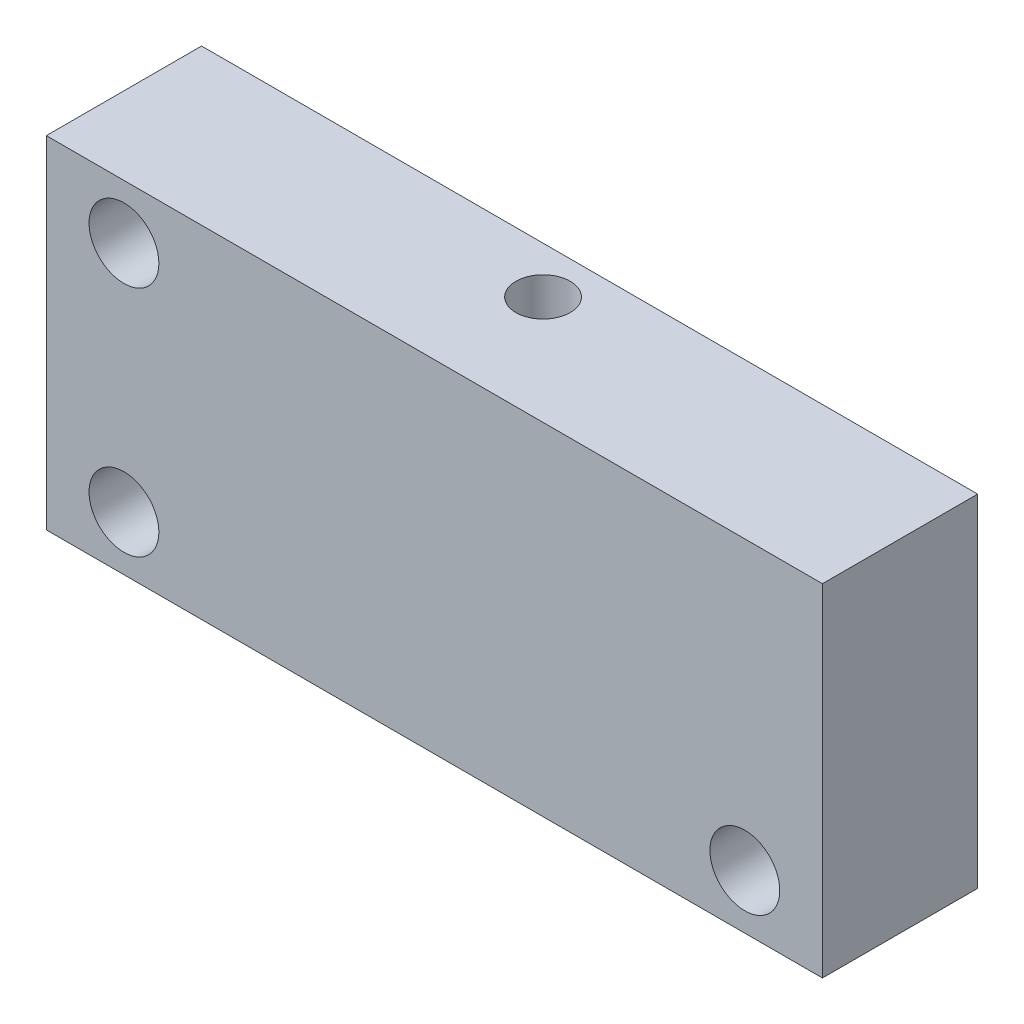
ISO-10303-21;
HEADER;
FILE_DESCRIPTION(('STEP AP214'),'2;1');
FILE_NAME('part.step','',(''),(''),'','','');
FILE_SCHEMA(('AUTOMOTIVE_DESIGN { 1 0 10303 214 1 1 1 1 }'));
ENDSEC;
DATA;
#1=APPLICATION_CONTEXT('core data for automotive mechanical design processes');
#2=APPLICATION_PROTOCOL_DEFINITION('international standard','automotive_design',2000,#1);
#3=PRODUCT_CONTEXT('',#1,'mechanical');
#4=PRODUCT('Part','Part','',(#3));
#5=PRODUCT_RELATED_PRODUCT_CATEGORY('part','',(#4));
#6=PRODUCT_DEFINITION_FORMATION('','',#4);
#7=PRODUCT_DEFINITION_CONTEXT('part definition',#1,'design');
#8=PRODUCT_DEFINITION('design','',#6,#7);
#9=PRODUCT_DEFINITION_SHAPE('','',#8);
#10=(LENGTH_UNIT() NAMED_UNIT(*) SI_UNIT(.MILLI.,.METRE.));
#11=(NAMED_UNIT(*) PLANE_ANGLE_UNIT() SI_UNIT($,.RADIAN.));
#12=(NAMED_UNIT(*) SI_UNIT($,.STERADIAN.) SOLID_ANGLE_UNIT());
#13=UNCERTAINTY_MEASURE_WITH_UNIT(LENGTH_MEASURE(1.E-05),#10,'distance_accuracy_value','');
#14=(GEOMETRIC_REPRESENTATION_CONTEXT(3) GLOBAL_UNCERTAINTY_ASSIGNED_CONTEXT((#13)) GLOBAL_UNIT_ASSIGNED_CONTEXT((#10,
#11,#12)) REPRESENTATION_CONTEXT('',''));
#15=CARTESIAN_POINT('',(0.,0.,0.));
#16=DIRECTION('',(0.,0.,1.));
#17=DIRECTION('',(1.,0.,0.));
#18=AXIS2_PLACEMENT_3D('',#15,#16,#17);
#19=CARTESIAN_POINT('',(-25.,-11.,10.));
#20=DIRECTION('',(1.,0.,0.));
#21=DIRECTION('',(0.,0.,-1.));
#22=AXIS2_PLACEMENT_3D('',#19,#20,#21);
#23=PLANE('',#22);
#24=DIRECTION('',(0.,-1.,0.));
#25=VECTOR('',#24,1.);
#26=CARTESIAN_POINT('',(-25.,-11.,0.));
#27=LINE('',#26,#25);
#28=CARTESIAN_POINT('',(-25.,11.,0.));
#29=VERTEX_POINT('',#28);
#30=CARTESIAN_POINT('',(-25.,-11.,0.));
#31=VERTEX_POINT('',#30);
#32=EDGE_CURVE('E161',#29,#31,#27,.T.);
#33=ORIENTED_EDGE('',*,*,#32,.T.);
#34=DIRECTION('',(0.,0.,-1.));
#35=VECTOR('',#34,1.);
#36=CARTESIAN_POINT('',(-25.,-11.,10.));
#37=LINE('',#36,#35);
#38=CARTESIAN_POINT('',(-25.,-11.,10.));
#39=VERTEX_POINT('',#38);
#40=EDGE_CURVE('E204',#39,#31,#37,.T.);
#41=ORIENTED_EDGE('',*,*,#40,.F.);
#42=DIRECTION('',(0.,-1.,0.));
#43=VECTOR('',#42,1.);
#44=CARTESIAN_POINT('',(-25.,-11.,10.));
#45=LINE('',#44,#43);
#46=CARTESIAN_POINT('',(-25.,11.,10.));
#47=VERTEX_POINT('',#46);
#48=EDGE_CURVE('E178',#47,#39,#45,.T.);
#49=ORIENTED_EDGE('',*,*,#48,.F.);
#50=DIRECTION('',(0.,0.,-1.));
#51=VECTOR('',#50,1.);
#52=CARTESIAN_POINT('',(-25.,11.,10.));
#53=LINE('',#52,#51);
#54=EDGE_CURVE('E188',#47,#29,#53,.T.);
#55=ORIENTED_EDGE('',*,*,#54,.T.);
#56=EDGE_LOOP('',(#33,#41,#49,#55));
#57=FACE_BOUND('',#56,.T.);
#58=ADVANCED_FACE('F33',(#57),#23,.F.);
#59=CARTESIAN_POINT('',(25.,-11.,10.));
#60=DIRECTION('',(0.,1.,0.));
#61=DIRECTION('',(-1.,0.,0.));
#62=AXIS2_PLACEMENT_3D('',#59,#60,#61);
#63=PLANE('',#62);
#64=DIRECTION('',(1.,0.,0.));
#65=VECTOR('',#64,1.);
#66=CARTESIAN_POINT('',(25.,-11.,0.));
#67=LINE('',#66,#65);
#68=CARTESIAN_POINT('',(25.,-11.,0.));
#69=VERTEX_POINT('',#68);
#70=EDGE_CURVE('E191',#31,#69,#67,.T.);
#71=ORIENTED_EDGE('',*,*,#70,.T.);
#72=DIRECTION('',(0.,0.,-1.));
#73=VECTOR('',#72,1.);
#74=CARTESIAN_POINT('',(25.,-11.,10.));
#75=LINE('',#74,#73);
#76=CARTESIAN_POINT('',(25.,-11.,10.));
#77=VERTEX_POINT('',#76);
#78=EDGE_CURVE('E201',#77,#69,#75,.T.);
#79=ORIENTED_EDGE('',*,*,#78,.F.);
#80=DIRECTION('',(1.,0.,0.));
#81=VECTOR('',#80,1.);
#82=CARTESIAN_POINT('',(25.,-11.,10.));
#83=LINE('',#82,#81);
#84=EDGE_CURVE('E181',#39,#77,#83,.T.);
#85=ORIENTED_EDGE('',*,*,#84,.F.);
#86=ORIENTED_EDGE('',*,*,#40,.T.);
#87=EDGE_LOOP('',(#71,#79,#85,#86));
#88=FACE_BOUND('',#87,.T.);
#89=ADVANCED_FACE('F286',(#88),#63,.F.);
#90=CARTESIAN_POINT('',(25.,-11.,10.));
#91=DIRECTION('',(-1.,0.,0.));
#92=DIRECTION('',(0.,0.,1.));
#93=AXIS2_PLACEMENT_3D('',#90,#91,#92);
#94=PLANE('',#93);
#95=DIRECTION('',(0.,1.,0.));
#96=VECTOR('',#95,1.);
#97=CARTESIAN_POINT('',(25.,-11.,0.));
#98=LINE('',#97,#96);
#99=CARTESIAN_POINT('',(25.,11.,0.));
#100=VERTEX_POINT('',#99);
#101=EDGE_CURVE('E193',#69,#100,#98,.T.);
#102=ORIENTED_EDGE('',*,*,#101,.T.);
#103=DIRECTION('',(0.,0.,-1.));
#104=VECTOR('',#103,1.);
#105=CARTESIAN_POINT('',(25.,11.,10.));
#106=LINE('',#105,#104);
#107=CARTESIAN_POINT('',(25.,11.,10.));
#108=VERTEX_POINT('',#107);
#109=EDGE_CURVE('E198',#108,#100,#106,.T.);
#110=ORIENTED_EDGE('',*,*,#109,.F.);
#111=DIRECTION('',(0.,1.,0.));
#112=VECTOR('',#111,1.);
#113=CARTESIAN_POINT('',(25.,-11.,10.));
#114=LINE('',#113,#112);
#115=EDGE_CURVE('E184',#77,#108,#114,.T.);
#116=ORIENTED_EDGE('',*,*,#115,.F.);
#117=ORIENTED_EDGE('',*,*,#78,.T.);
#118=EDGE_LOOP('',(#102,#110,#116,#117));
#119=FACE_BOUND('',#118,.T.);
#120=ADVANCED_FACE('F291',(#119),#94,.F.);
#121=CARTESIAN_POINT('',(25.,11.,10.));
#122=DIRECTION('',(0.,-1.,0.));
#123=DIRECTION('',(1.,0.,0.));
#124=AXIS2_PLACEMENT_3D('',#121,#122,#123);
#125=PLANE('',#124);
#126=CARTESIAN_POINT('',(0.,11.,3.));
#127=DIRECTION('',(0.,1.,0.));
#128=DIRECTION('',(-1.,0.,0.));
#129=AXIS2_PLACEMENT_3D('',#126,#127,#128);
#130=CIRCLE('',#129,1.75);
#131=CARTESIAN_POINT('',(-1.75,11.,3.));
#132=VERTEX_POINT('',#131);
#133=EDGE_CURVE('E247',#132,#132,#130,.T.);
#134=ORIENTED_EDGE('',*,*,#133,.F.);
#135=EDGE_LOOP('',(#134));
#136=FACE_BOUND('',#135,.T.);
#137=DIRECTION('',(-1.,0.,0.));
#138=VECTOR('',#137,1.);
#139=CARTESIAN_POINT('',(25.,11.,0.));
#140=LINE('',#139,#138);
#141=EDGE_CURVE('E182',#100,#29,#140,.T.);
#142=ORIENTED_EDGE('',*,*,#141,.T.);
#143=ORIENTED_EDGE('',*,*,#54,.F.);
#144=DIRECTION('',(-1.,0.,0.));
#145=VECTOR('',#144,1.);
#146=CARTESIAN_POINT('',(25.,11.,10.));
#147=LINE('',#146,#145);
#148=EDGE_CURVE('E186',#108,#47,#147,.T.);
#149=ORIENTED_EDGE('',*,*,#148,.F.);
#150=ORIENTED_EDGE('',*,*,#109,.T.);
#151=EDGE_LOOP('',(#142,#143,#149,#150));
#152=FACE_BOUND('',#151,.T.);
#153=ADVANCED_FACE('F307',(#136,#152),#125,.F.);
#154=CARTESIAN_POINT('',(0.,0.,10.));
#155=DIRECTION('',(0.,0.,1.));
#156=DIRECTION('',(1.,0.,0.));
#157=AXIS2_PLACEMENT_3D('',#154,#155,#156);
#158=PLANE('',#157);
#159=CARTESIAN_POINT('',(-20.,7.5,10.));
#160=DIRECTION('',(0.,0.,1.));
#161=DIRECTION('',(1.,0.,0.));
#162=AXIS2_PLACEMENT_3D('',#159,#160,#161);
#163=CIRCLE('',#162,2.25);
#164=CARTESIAN_POINT('',(-17.75,7.5,10.));
#165=VERTEX_POINT('',#164);
#166=EDGE_CURVE('E162',#165,#165,#163,.T.);
#167=ORIENTED_EDGE('',*,*,#166,.F.);
#168=EDGE_LOOP('',(#167));
#169=FACE_BOUND('',#168,.T.);
#170=CARTESIAN_POINT('',(-20.,-7.5,10.));
#171=DIRECTION('',(0.,0.,1.));
#172=DIRECTION('',(1.,0.,0.));
#173=AXIS2_PLACEMENT_3D('',#170,#171,#172);
#174=CIRCLE('',#173,2.25);
#175=CARTESIAN_POINT('',(-17.75,-7.5,10.));
#176=VERTEX_POINT('',#175);
#177=EDGE_CURVE('E168',#176,#176,#174,.T.);
#178=ORIENTED_EDGE('',*,*,#177,.F.);
#179=EDGE_LOOP('',(#178));
#180=FACE_BOUND('',#179,.T.);
#181=CARTESIAN_POINT('',(20.,-7.5,10.));
#182=DIRECTION('',(0.,0.,1.));
#183=DIRECTION('',(1.,0.,0.));
#184=AXIS2_PLACEMENT_3D('',#181,#182,#183);
#185=CIRCLE('',#184,2.25);
#186=CARTESIAN_POINT('',(22.25,-7.5,10.));
#187=VERTEX_POINT('',#186);
#188=EDGE_CURVE('E174',#187,#187,#185,.T.);
#189=ORIENTED_EDGE('',*,*,#188,.F.);
#190=EDGE_LOOP('',(#189));
#191=FACE_BOUND('',#190,.T.);
#192=ORIENTED_EDGE('',*,*,#48,.T.);
#193=ORIENTED_EDGE('',*,*,#84,.T.);
#194=ORIENTED_EDGE('',*,*,#115,.T.);
#195=ORIENTED_EDGE('',*,*,#148,.T.);
#196=EDGE_LOOP('',(#192,#193,#194,#195));
#197=FACE_BOUND('',#196,.T.);
#198=ADVANCED_FACE('F303',(#169,#180,#191,#197),#158,.T.);
#199=CARTESIAN_POINT('',(0.,0.,0.));
#200=DIRECTION('',(0.,0.,1.));
#201=DIRECTION('',(1.,0.,0.));
#202=AXIS2_PLACEMENT_3D('',#199,#200,#201);
#203=PLANE('',#202);
#204=DIRECTION('',(1.,0.,0.));
#205=VECTOR('',#204,1.);
#206=CARTESIAN_POINT('',(-6.45,6.45,0.));
#207=LINE('',#206,#205);
#208=CARTESIAN_POINT('',(-4.45,6.45,0.));
#209=VERTEX_POINT('',#208);
#210=CARTESIAN_POINT('',(4.45,6.45,0.));
#211=VERTEX_POINT('',#210);
#212=EDGE_CURVE('E140',#209,#211,#207,.T.);
#213=ORIENTED_EDGE('',*,*,#212,.F.);
#214=CARTESIAN_POINT('',(-6.45,6.45,0.));
#215=DIRECTION('',(0.,0.,-1.));
#216=DIRECTION('',(-1.,0.,0.));
#217=AXIS2_PLACEMENT_3D('',#214,#215,#216);
#218=CIRCLE('',#217,2.);
#219=CARTESIAN_POINT('',(-6.45,4.45,0.));
#220=VERTEX_POINT('',#219);
#221=EDGE_CURVE('E252',#220,#209,#218,.T.);
#222=ORIENTED_EDGE('',*,*,#221,.F.);
#223=DIRECTION('',(0.,1.,0.));
#224=VECTOR('',#223,1.);
#225=CARTESIAN_POINT('',(-6.45,-6.45,0.));
#226=LINE('',#225,#224);
#227=CARTESIAN_POINT('',(-6.45,-4.45,0.));
#228=VERTEX_POINT('',#227);
#229=EDGE_CURVE('E148',#228,#220,#226,.T.);
#230=ORIENTED_EDGE('',*,*,#229,.F.);
#231=CARTESIAN_POINT('',(-6.45,-6.45,0.));
#232=DIRECTION('',(0.,0.,-1.));
#233=DIRECTION('',(-1.,0.,0.));
#234=AXIS2_PLACEMENT_3D('',#231,#232,#233);
#235=CIRCLE('',#234,2.);
#236=CARTESIAN_POINT('',(-4.45,-6.45,0.));
#237=VERTEX_POINT('',#236);
#238=EDGE_CURVE('E241',#237,#228,#235,.T.);
#239=ORIENTED_EDGE('',*,*,#238,.F.);
#240=DIRECTION('',(-1.,0.,0.));
#241=VECTOR('',#240,1.);
#242=CARTESIAN_POINT('',(-6.45,-6.45,0.));
#243=LINE('',#242,#241);
#244=CARTESIAN_POINT('',(4.45,-6.45,0.));
#245=VERTEX_POINT('',#244);
#246=EDGE_CURVE('E154',#245,#237,#243,.T.);
#247=ORIENTED_EDGE('',*,*,#246,.F.);
#248=CARTESIAN_POINT('',(6.45,-6.45,0.));
#249=DIRECTION('',(0.,0.,-1.));
#250=DIRECTION('',(-1.,0.,0.));
#251=AXIS2_PLACEMENT_3D('',#248,#249,#250);
#252=CIRCLE('',#251,2.);
#253=CARTESIAN_POINT('',(6.45,-4.45,0.));
#254=VERTEX_POINT('',#253);
#255=EDGE_CURVE('E239',#254,#245,#252,.T.);
#256=ORIENTED_EDGE('',*,*,#255,.F.);
#257=DIRECTION('',(0.,-1.,0.));
#258=VECTOR('',#257,1.);
#259=CARTESIAN_POINT('',(6.45,-6.45,0.));
#260=LINE('',#259,#258);
#261=CARTESIAN_POINT('',(6.45,4.45,0.));
#262=VERTEX_POINT('',#261);
#263=EDGE_CURVE('E143',#262,#254,#260,.T.);
#264=ORIENTED_EDGE('',*,*,#263,.F.);
#265=CARTESIAN_POINT('',(6.45,6.45,0.));
#266=DIRECTION('',(0.,0.,-1.));
#267=DIRECTION('',(-1.,0.,0.));
#268=AXIS2_PLACEMENT_3D('',#265,#266,#267);
#269=CIRCLE('',#268,2.);
#270=EDGE_CURVE('E123',#211,#262,#269,.T.);
#271=ORIENTED_EDGE('',*,*,#270,.F.);
#272=EDGE_LOOP('',(#213,#222,#230,#239,#247,#256,#264,#271));
#273=FACE_BOUND('',#272,.T.);
#274=CARTESIAN_POINT('',(-20.,7.5,0.));
#275=DIRECTION('',(0.,0.,1.));
#276=DIRECTION('',(1.,0.,0.));
#277=AXIS2_PLACEMENT_3D('',#274,#275,#276);
#278=CIRCLE('',#277,2.25);
#279=CARTESIAN_POINT('',(-17.75,7.5,0.));
#280=VERTEX_POINT('',#279);
#281=EDGE_CURVE('E158',#280,#280,#278,.T.);
#282=ORIENTED_EDGE('',*,*,#281,.T.);
#283=EDGE_LOOP('',(#282));
#284=FACE_BOUND('',#283,.T.);
#285=CARTESIAN_POINT('',(-20.,-7.5,0.));
#286=DIRECTION('',(0.,0.,1.));
#287=DIRECTION('',(1.,0.,0.));
#288=AXIS2_PLACEMENT_3D('',#285,#286,#287);
#289=CIRCLE('',#288,2.25);
#290=CARTESIAN_POINT('',(-17.75,-7.5,0.));
#291=VERTEX_POINT('',#290);
#292=EDGE_CURVE('E165',#291,#291,#289,.T.);
#293=ORIENTED_EDGE('',*,*,#292,.T.);
#294=EDGE_LOOP('',(#293));
#295=FACE_BOUND('',#294,.T.);
#296=CARTESIAN_POINT('',(20.,-7.5,0.));
#297=DIRECTION('',(0.,0.,1.));
#298=DIRECTION('',(1.,0.,0.));
#299=AXIS2_PLACEMENT_3D('',#296,#297,#298);
#300=CIRCLE('',#299,2.25);
#301=CARTESIAN_POINT('',(22.25,-7.5,0.));
#302=VERTEX_POINT('',#301);
#303=EDGE_CURVE('E171',#302,#302,#300,.T.);
#304=ORIENTED_EDGE('',*,*,#303,.T.);
#305=EDGE_LOOP('',(#304));
#306=FACE_BOUND('',#305,.T.);
#307=ORIENTED_EDGE('',*,*,#32,.F.);
#308=ORIENTED_EDGE('',*,*,#141,.F.);
#309=ORIENTED_EDGE('',*,*,#101,.F.);
#310=ORIENTED_EDGE('',*,*,#70,.F.);
#311=EDGE_LOOP('',(#307,#308,#309,#310));
#312=FACE_BOUND('',#311,.T.);
#313=ADVANCED_FACE('F137',(#273,#284,#295,#306,#312),#203,.F.);
#314=CARTESIAN_POINT('',(20.,-7.5,0.));
#315=DIRECTION('',(0.,0.,1.));
#316=DIRECTION('',(1.,0.,0.));
#317=AXIS2_PLACEMENT_3D('',#314,#315,#316);
#318=CYLINDRICAL_SURFACE('',#317,2.25);
#319=ORIENTED_EDGE('',*,*,#303,.F.);
#320=EDGE_LOOP('',(#319));
#321=FACE_BOUND('',#320,.T.);
#322=ORIENTED_EDGE('',*,*,#188,.T.);
#323=EDGE_LOOP('',(#322));
#324=FACE_BOUND('',#323,.T.);
#325=ADVANCED_FACE('F320',(#321,#324),#318,.F.);
#326=CARTESIAN_POINT('',(-20.,-7.5,0.));
#327=DIRECTION('',(0.,0.,1.));
#328=DIRECTION('',(1.,0.,0.));
#329=AXIS2_PLACEMENT_3D('',#326,#327,#328);
#330=CYLINDRICAL_SURFACE('',#329,2.25);
#331=ORIENTED_EDGE('',*,*,#292,.F.);
#332=EDGE_LOOP('',(#331));
#333=FACE_BOUND('',#332,.T.);
#334=ORIENTED_EDGE('',*,*,#177,.T.);
#335=EDGE_LOOP('',(#334));
#336=FACE_BOUND('',#335,.T.);
#337=ADVANCED_FACE('F326',(#333,#336),#330,.F.);
#338=CARTESIAN_POINT('',(-20.,7.5,0.));
#339=DIRECTION('',(0.,0.,1.));
#340=DIRECTION('',(1.,0.,0.));
#341=AXIS2_PLACEMENT_3D('',#338,#339,#340);
#342=CYLINDRICAL_SURFACE('',#341,2.25);
#343=ORIENTED_EDGE('',*,*,#281,.F.);
#344=EDGE_LOOP('',(#343));
#345=FACE_BOUND('',#344,.T.);
#346=ORIENTED_EDGE('',*,*,#166,.T.);
#347=EDGE_LOOP('',(#346));
#348=FACE_BOUND('',#347,.T.);
#349=ADVANCED_FACE('F330',(#345,#348),#342,.F.);
#350=CARTESIAN_POINT('',(6.45,-6.45,6.));
#351=DIRECTION('',(1.,0.,0.));
#352=DIRECTION('',(0.,0.,-1.));
#353=AXIS2_PLACEMENT_3D('',#350,#351,#352);
#354=PLANE('',#353);
#355=ORIENTED_EDGE('',*,*,#263,.T.);
#356=DIRECTION('',(0.,0.,-1.));
#357=VECTOR('',#356,1.);
#358=CARTESIAN_POINT('',(6.45,-4.45,6.1));
#359=LINE('',#358,#357);
#360=CARTESIAN_POINT('',(6.45,-4.45,6.));
#361=VERTEX_POINT('',#360);
#362=EDGE_CURVE('E214',#254,#361,#359,.F.);
#363=ORIENTED_EDGE('',*,*,#362,.T.);
#364=DIRECTION('',(0.,-1.,0.));
#365=VECTOR('',#364,1.);
#366=CARTESIAN_POINT('',(6.45,-6.45,6.));
#367=LINE('',#366,#365);
#368=CARTESIAN_POINT('',(6.45,4.45,6.));
#369=VERTEX_POINT('',#368);
#370=EDGE_CURVE('E147',#369,#361,#367,.T.);
#371=ORIENTED_EDGE('',*,*,#370,.F.);
#372=DIRECTION('',(0.,0.,-1.));
#373=VECTOR('',#372,1.);
#374=CARTESIAN_POINT('',(6.45,4.45,6.1));
#375=LINE('',#374,#373);
#376=EDGE_CURVE('E131',#369,#262,#375,.T.);
#377=ORIENTED_EDGE('',*,*,#376,.T.);
#378=EDGE_LOOP('',(#355,#363,#371,#377));
#379=FACE_BOUND('',#378,.T.);
#380=ADVANCED_FACE('F222',(#379),#354,.F.);
#381=CARTESIAN_POINT('',(-6.45,6.45,6.));
#382=DIRECTION('',(0.,1.,0.));
#383=DIRECTION('',(-1.,0.,0.));
#384=AXIS2_PLACEMENT_3D('',#381,#382,#383);
#385=PLANE('',#384);
#386=CARTESIAN_POINT('',(0.,6.45,3.));
#387=DIRECTION('',(0.,1.,0.));
#388=DIRECTION('',(-1.,0.,0.));
#389=AXIS2_PLACEMENT_3D('',#386,#387,#388);
#390=CIRCLE('',#389,1.75);
#391=CARTESIAN_POINT('',(-1.75,6.45,3.));
#392=VERTEX_POINT('',#391);
#393=EDGE_CURVE('E36',#392,#392,#390,.T.);
#394=ORIENTED_EDGE('',*,*,#393,.T.);
#395=EDGE_LOOP('',(#394));
#396=FACE_BOUND('',#395,.T.);
#397=DIRECTION('',(1.,0.,0.));
#398=VECTOR('',#397,1.);
#399=CARTESIAN_POINT('',(-6.45,6.45,6.));
#400=LINE('',#399,#398);
#401=CARTESIAN_POINT('',(-4.45,6.45,6.));
#402=VERTEX_POINT('',#401);
#403=CARTESIAN_POINT('',(4.45,6.45,6.));
#404=VERTEX_POINT('',#403);
#405=EDGE_CURVE('E177',#402,#404,#400,.T.);
#406=ORIENTED_EDGE('',*,*,#405,.F.);
#407=DIRECTION('',(0.,0.,-1.));
#408=VECTOR('',#407,1.);
#409=CARTESIAN_POINT('',(-4.45,6.45,6.1));
#410=LINE('',#409,#408);
#411=EDGE_CURVE('E47',#402,#209,#410,.T.);
#412=ORIENTED_EDGE('',*,*,#411,.T.);
#413=ORIENTED_EDGE('',*,*,#212,.T.);
#414=DIRECTION('',(0.,0.,-1.));
#415=VECTOR('',#414,1.);
#416=CARTESIAN_POINT('',(4.45,6.45,6.1));
#417=LINE('',#416,#415);
#418=EDGE_CURVE('E120',#211,#404,#417,.F.);
#419=ORIENTED_EDGE('',*,*,#418,.T.);
#420=EDGE_LOOP('',(#406,#412,#413,#419));
#421=FACE_BOUND('',#420,.T.);
#422=ADVANCED_FACE('F146',(#396,#421),#385,.F.);
#423=CARTESIAN_POINT('',(-6.45,-6.45,6.));
#424=DIRECTION('',(-1.,0.,0.));
#425=DIRECTION('',(0.,0.,1.));
#426=AXIS2_PLACEMENT_3D('',#423,#424,#425);
#427=PLANE('',#426);
#428=ORIENTED_EDGE('',*,*,#229,.T.);
#429=DIRECTION('',(0.,0.,-1.));
#430=VECTOR('',#429,1.);
#431=CARTESIAN_POINT('',(-6.45,4.45,6.1));
#432=LINE('',#431,#430);
#433=CARTESIAN_POINT('',(-6.45,4.45,6.));
#434=VERTEX_POINT('',#433);
#435=EDGE_CURVE('E223',#220,#434,#432,.F.);
#436=ORIENTED_EDGE('',*,*,#435,.T.);
#437=DIRECTION('',(0.,1.,0.));
#438=VECTOR('',#437,1.);
#439=CARTESIAN_POINT('',(-6.45,-6.45,6.));
#440=LINE('',#439,#438);
#441=CARTESIAN_POINT('',(-6.45,-4.45,6.));
#442=VERTEX_POINT('',#441);
#443=EDGE_CURVE('E227',#442,#434,#440,.T.);
#444=ORIENTED_EDGE('',*,*,#443,.F.);
#445=DIRECTION('',(0.,0.,-1.));
#446=VECTOR('',#445,1.);
#447=CARTESIAN_POINT('',(-6.45,-4.45,6.1));
#448=LINE('',#447,#446);
#449=EDGE_CURVE('E55',#442,#228,#448,.T.);
#450=ORIENTED_EDGE('',*,*,#449,.T.);
#451=EDGE_LOOP('',(#428,#436,#444,#450));
#452=FACE_BOUND('',#451,.T.);
#453=ADVANCED_FACE('F268',(#452),#427,.F.);
#454=CARTESIAN_POINT('',(-6.45,-6.45,6.));
#455=DIRECTION('',(0.,-1.,0.));
#456=DIRECTION('',(1.,0.,0.));
#457=AXIS2_PLACEMENT_3D('',#454,#455,#456);
#458=PLANE('',#457);
#459=DIRECTION('',(-1.,0.,0.));
#460=VECTOR('',#459,1.);
#461=CARTESIAN_POINT('',(-6.45,-6.45,6.));
#462=LINE('',#461,#460);
#463=CARTESIAN_POINT('',(4.45,-6.45,6.));
#464=VERTEX_POINT('',#463);
#465=CARTESIAN_POINT('',(-4.45,-6.45,6.));
#466=VERTEX_POINT('',#465);
#467=EDGE_CURVE('E151',#464,#466,#462,.T.);
#468=ORIENTED_EDGE('',*,*,#467,.F.);
#469=DIRECTION('',(0.,0.,-1.));
#470=VECTOR('',#469,1.);
#471=CARTESIAN_POINT('',(4.45,-6.45,6.1));
#472=LINE('',#471,#470);
#473=EDGE_CURVE('E216',#464,#245,#472,.T.);
#474=ORIENTED_EDGE('',*,*,#473,.T.);
#475=ORIENTED_EDGE('',*,*,#246,.T.);
#476=DIRECTION('',(0.,0.,-1.));
#477=VECTOR('',#476,1.);
#478=CARTESIAN_POINT('',(-4.45,-6.45,6.1));
#479=LINE('',#478,#477);
#480=EDGE_CURVE('E237',#237,#466,#479,.F.);
#481=ORIENTED_EDGE('',*,*,#480,.T.);
#482=EDGE_LOOP('',(#468,#474,#475,#481));
#483=FACE_BOUND('',#482,.T.);
#484=ADVANCED_FACE('F236',(#483),#458,.F.);
#485=CARTESIAN_POINT('',(0.,0.,6.));
#486=DIRECTION('',(0.,0.,-1.));
#487=DIRECTION('',(-1.,0.,0.));
#488=AXIS2_PLACEMENT_3D('',#485,#486,#487);
#489=PLANE('',#488);
#490=CARTESIAN_POINT('',(-6.45,6.45,6.));
#491=DIRECTION('',(0.,0.,-1.));
#492=DIRECTION('',(-1.,0.,0.));
#493=AXIS2_PLACEMENT_3D('',#490,#491,#492);
#494=CIRCLE('',#493,2.);
#495=EDGE_CURVE('E11',#402,#434,#494,.T.);
#496=ORIENTED_EDGE('',*,*,#495,.F.);
#497=ORIENTED_EDGE('',*,*,#405,.T.);
#498=CARTESIAN_POINT('',(6.45,6.45,6.));
#499=DIRECTION('',(0.,0.,-1.));
#500=DIRECTION('',(-1.,0.,0.));
#501=AXIS2_PLACEMENT_3D('',#498,#499,#500);
#502=CIRCLE('',#501,2.);
#503=EDGE_CURVE('E126',#369,#404,#502,.T.);
#504=ORIENTED_EDGE('',*,*,#503,.F.);
#505=ORIENTED_EDGE('',*,*,#370,.T.);
#506=CARTESIAN_POINT('',(6.45,-6.45,6.));
#507=DIRECTION('',(0.,0.,-1.));
#508=DIRECTION('',(-1.,0.,0.));
#509=AXIS2_PLACEMENT_3D('',#506,#507,#508);
#510=CIRCLE('',#509,2.);
#511=EDGE_CURVE('E41',#464,#361,#510,.T.);
#512=ORIENTED_EDGE('',*,*,#511,.F.);
#513=ORIENTED_EDGE('',*,*,#467,.T.);
#514=CARTESIAN_POINT('',(-6.45,-6.45,6.));
#515=DIRECTION('',(0.,0.,-1.));
#516=DIRECTION('',(-1.,0.,0.));
#517=AXIS2_PLACEMENT_3D('',#514,#515,#516);
#518=CIRCLE('',#517,2.);
#519=EDGE_CURVE('E208',#442,#466,#518,.T.);
#520=ORIENTED_EDGE('',*,*,#519,.F.);
#521=ORIENTED_EDGE('',*,*,#443,.T.);
#522=EDGE_LOOP('',(#496,#497,#504,#505,#512,#513,#520,#521));
#523=FACE_BOUND('',#522,.T.);
#524=ADVANCED_FACE('F225',(#523),#489,.T.);
#525=CARTESIAN_POINT('',(6.45,6.45,6.1));
#526=DIRECTION('',(0.,0.,-1.));
#527=DIRECTION('',(-1.,0.,0.));
#528=AXIS2_PLACEMENT_3D('',#525,#526,#527);
#529=CYLINDRICAL_SURFACE('',#528,2.);
#530=CARTESIAN_POINT('',(6.45,6.45,6.1));
#531=DIRECTION('',(0.,0.,-1.));
#532=DIRECTION('',(-1.,0.,0.));
#533=AXIS2_PLACEMENT_3D('',#530,#531,#532);
#534=CIRCLE('',#533,2.);
#535=CARTESIAN_POINT('',(4.45,6.45,6.1));
#536=VERTEX_POINT('',#535);
#537=EDGE_CURVE('E132',#536,#536,#534,.T.);
#538=ORIENTED_EDGE('',*,*,#537,.F.);
#539=EDGE_LOOP('',(#538));
#540=FACE_BOUND('',#539,.T.);
#541=ORIENTED_EDGE('',*,*,#503,.T.);
#542=ORIENTED_EDGE('',*,*,#418,.F.);
#543=ORIENTED_EDGE('',*,*,#270,.T.);
#544=ORIENTED_EDGE('',*,*,#376,.F.);
#545=EDGE_LOOP('',(#541,#542,#543,#544));
#546=FACE_BOUND('',#545,.T.);
#547=ADVANCED_FACE('F122',(#540,#546),#529,.F.);
#548=CARTESIAN_POINT('',(6.45,6.45,6.1));
#549=DIRECTION('',(0.,0.,-1.));
#550=DIRECTION('',(-1.,0.,0.));
#551=AXIS2_PLACEMENT_3D('',#548,#549,#550);
#552=PLANE('',#551);
#553=ORIENTED_EDGE('',*,*,#537,.T.);
#554=EDGE_LOOP('',(#553));
#555=FACE_BOUND('',#554,.T.);
#556=ADVANCED_FACE('F348',(#555),#552,.T.);
#557=CARTESIAN_POINT('',(-6.45,-6.45,6.1));
#558=DIRECTION('',(0.,0.,-1.));
#559=DIRECTION('',(-1.,0.,0.));
#560=AXIS2_PLACEMENT_3D('',#557,#558,#559);
#561=CYLINDRICAL_SURFACE('',#560,2.);
#562=CARTESIAN_POINT('',(-6.45,-6.45,6.1));
#563=DIRECTION('',(0.,0.,-1.));
#564=DIRECTION('',(-1.,0.,0.));
#565=AXIS2_PLACEMENT_3D('',#562,#563,#564);
#566=CIRCLE('',#565,2.);
#567=CARTESIAN_POINT('',(-8.45,-6.45,6.1));
#568=VERTEX_POINT('',#567);
#569=EDGE_CURVE('E242',#568,#568,#566,.T.);
#570=ORIENTED_EDGE('',*,*,#569,.F.);
#571=EDGE_LOOP('',(#570));
#572=FACE_BOUND('',#571,.T.);
#573=ORIENTED_EDGE('',*,*,#519,.T.);
#574=ORIENTED_EDGE('',*,*,#480,.F.);
#575=ORIENTED_EDGE('',*,*,#238,.T.);
#576=ORIENTED_EDGE('',*,*,#449,.F.);
#577=EDGE_LOOP('',(#573,#574,#575,#576));
#578=FACE_BOUND('',#577,.T.);
#579=ADVANCED_FACE('F352',(#572,#578),#561,.F.);
#580=CARTESIAN_POINT('',(-6.45,-6.45,6.1));
#581=DIRECTION('',(0.,0.,-1.));
#582=DIRECTION('',(-1.,0.,0.));
#583=AXIS2_PLACEMENT_3D('',#580,#581,#582);
#584=PLANE('',#583);
#585=ORIENTED_EDGE('',*,*,#569,.T.);
#586=EDGE_LOOP('',(#585));
#587=FACE_BOUND('',#586,.T.);
#588=ADVANCED_FACE('F355',(#587),#584,.T.);
#589=CARTESIAN_POINT('',(6.45,-6.45,6.1));
#590=DIRECTION('',(0.,0.,-1.));
#591=DIRECTION('',(-1.,0.,0.));
#592=AXIS2_PLACEMENT_3D('',#589,#590,#591);
#593=CYLINDRICAL_SURFACE('',#592,2.);
#594=CARTESIAN_POINT('',(6.45,-6.45,6.1));
#595=DIRECTION('',(0.,0.,-1.));
#596=DIRECTION('',(-1.,0.,0.));
#597=AXIS2_PLACEMENT_3D('',#594,#595,#596);
#598=CIRCLE('',#597,2.);
#599=CARTESIAN_POINT('',(4.45,-6.45,6.1));
#600=VERTEX_POINT('',#599);
#601=EDGE_CURVE('E254',#600,#600,#598,.T.);
#602=ORIENTED_EDGE('',*,*,#601,.F.);
#603=EDGE_LOOP('',(#602));
#604=FACE_BOUND('',#603,.T.);
#605=ORIENTED_EDGE('',*,*,#255,.T.);
#606=ORIENTED_EDGE('',*,*,#473,.F.);
#607=ORIENTED_EDGE('',*,*,#511,.T.);
#608=ORIENTED_EDGE('',*,*,#362,.F.);
#609=EDGE_LOOP('',(#605,#606,#607,#608));
#610=FACE_BOUND('',#609,.T.);
#611=ADVANCED_FACE('F213',(#604,#610),#593,.F.);
#612=CARTESIAN_POINT('',(6.45,-6.45,6.1));
#613=DIRECTION('',(0.,0.,-1.));
#614=DIRECTION('',(-1.,0.,0.));
#615=AXIS2_PLACEMENT_3D('',#612,#613,#614);
#616=PLANE('',#615);
#617=ORIENTED_EDGE('',*,*,#601,.T.);
#618=EDGE_LOOP('',(#617));
#619=FACE_BOUND('',#618,.T.);
#620=ADVANCED_FACE('F272',(#619),#616,.T.);
#621=CARTESIAN_POINT('',(-6.45,6.45,6.1));
#622=DIRECTION('',(0.,0.,-1.));
#623=DIRECTION('',(-1.,0.,0.));
#624=AXIS2_PLACEMENT_3D('',#621,#622,#623);
#625=CYLINDRICAL_SURFACE('',#624,2.);
#626=CARTESIAN_POINT('',(-6.45,6.45,6.1));
#627=DIRECTION('',(0.,0.,-1.));
#628=DIRECTION('',(-1.,0.,0.));
#629=AXIS2_PLACEMENT_3D('',#626,#627,#628);
#630=CIRCLE('',#629,2.);
#631=CARTESIAN_POINT('',(-8.45,6.45,6.1));
#632=VERTEX_POINT('',#631);
#633=EDGE_CURVE('E144',#632,#632,#630,.T.);
#634=ORIENTED_EDGE('',*,*,#633,.F.);
#635=EDGE_LOOP('',(#634));
#636=FACE_BOUND('',#635,.T.);
#637=ORIENTED_EDGE('',*,*,#495,.T.);
#638=ORIENTED_EDGE('',*,*,#435,.F.);
#639=ORIENTED_EDGE('',*,*,#221,.T.);
#640=ORIENTED_EDGE('',*,*,#411,.F.);
#641=EDGE_LOOP('',(#637,#638,#639,#640));
#642=FACE_BOUND('',#641,.T.);
#643=ADVANCED_FACE('F269',(#636,#642),#625,.F.);
#644=CARTESIAN_POINT('',(-6.45,6.45,6.1));
#645=DIRECTION('',(0.,0.,-1.));
#646=DIRECTION('',(-1.,0.,0.));
#647=AXIS2_PLACEMENT_3D('',#644,#645,#646);
#648=PLANE('',#647);
#649=ORIENTED_EDGE('',*,*,#633,.T.);
#650=EDGE_LOOP('',(#649));
#651=FACE_BOUND('',#650,.T.);
#652=ADVANCED_FACE('F271',(#651),#648,.T.);
#653=CARTESIAN_POINT('',(0.,4.9,3.));
#654=DIRECTION('',(0.,1.,0.));
#655=DIRECTION('',(-1.,0.,0.));
#656=AXIS2_PLACEMENT_3D('',#653,#654,#655);
#657=CYLINDRICAL_SURFACE('',#656,1.75);
#658=ORIENTED_EDGE('',*,*,#133,.T.);
#659=EDGE_LOOP('',(#658));
#660=FACE_BOUND('',#659,.T.);
#661=ORIENTED_EDGE('',*,*,#393,.F.);
#662=EDGE_LOOP('',(#661));
#663=FACE_BOUND('',#662,.T.);
#664=ADVANCED_FACE('F279',(#660,#663),#657,.F.);
#665=CLOSED_SHELL('',(#58,#89,#120,#153,#198,#313,#325,#337,#349,#380,#422,#453,#484,#524,#547,
#556,#579,#588,#611,#620,#643,#652,#664));
#666=MANIFOLD_SOLID_BREP('B2',#665);
#667=ADVANCED_BREP_SHAPE_REPRESENTATION('',(#18,#666),#14);
#668=SHAPE_DEFINITION_REPRESENTATION(#9,#667);
ENDSEC;
END-ISO-10303-21;
